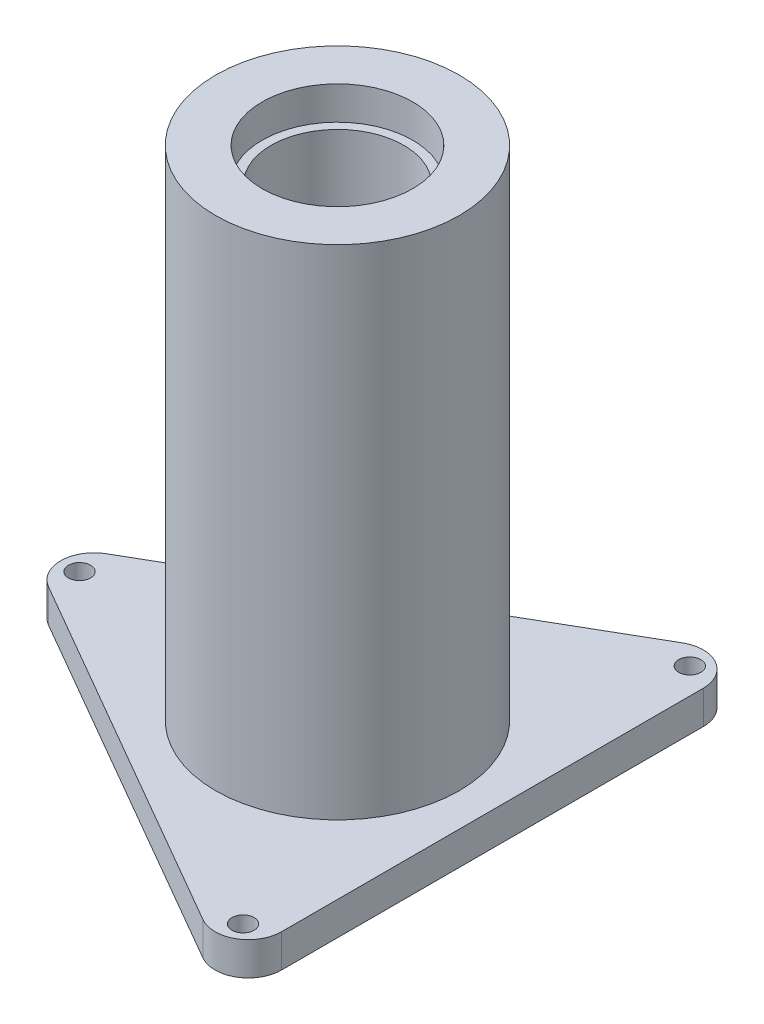
ISO-10303-21;
HEADER;
FILE_DESCRIPTION(('STEP AP214'),'2;1');
FILE_NAME('part.step','',(''),(''),'','','');
FILE_SCHEMA(('AUTOMOTIVE_DESIGN { 1 0 10303 214 1 1 1 1 }'));
ENDSEC;
DATA;
#1=APPLICATION_CONTEXT('core data for automotive mechanical design processes');
#2=APPLICATION_PROTOCOL_DEFINITION('international standard','automotive_design',2000,#1);
#3=PRODUCT_CONTEXT('',#1,'mechanical');
#4=PRODUCT('Part','Part','',(#3));
#5=PRODUCT_RELATED_PRODUCT_CATEGORY('part','',(#4));
#6=PRODUCT_DEFINITION_FORMATION('','',#4);
#7=PRODUCT_DEFINITION_CONTEXT('part definition',#1,'design');
#8=PRODUCT_DEFINITION('design','',#6,#7);
#9=PRODUCT_DEFINITION_SHAPE('','',#8);
#10=(LENGTH_UNIT() NAMED_UNIT(*) SI_UNIT(.MILLI.,.METRE.));
#11=(NAMED_UNIT(*) PLANE_ANGLE_UNIT() SI_UNIT($,.RADIAN.));
#12=(NAMED_UNIT(*) SI_UNIT($,.STERADIAN.) SOLID_ANGLE_UNIT());
#13=UNCERTAINTY_MEASURE_WITH_UNIT(LENGTH_MEASURE(1.E-05),#10,'distance_accuracy_value','');
#14=(GEOMETRIC_REPRESENTATION_CONTEXT(3) GLOBAL_UNCERTAINTY_ASSIGNED_CONTEXT((#13)) GLOBAL_UNIT_ASSIGNED_CONTEXT((#10,
#11,#12)) REPRESENTATION_CONTEXT('',''));
#15=CARTESIAN_POINT('',(0.,0.,0.));
#16=DIRECTION('',(0.,0.,1.));
#17=DIRECTION('',(1.,0.,0.));
#18=AXIS2_PLACEMENT_3D('',#15,#16,#17);
#19=CARTESIAN_POINT('',(6.00000000000001,-32.71875,0.));
#20=DIRECTION('',(0.,1.,0.));
#21=DIRECTION('',(0.,0.,1.));
#22=AXIS2_PLACEMENT_3D('',#19,#20,#21);
#23=PLANE('',#22);
#24=CARTESIAN_POINT('',(0.,-32.71875,0.));
#25=DIRECTION('',(0.,1.,0.));
#26=DIRECTION('',(0.,0.,1.));
#27=AXIS2_PLACEMENT_3D('',#24,#25,#26);
#28=CIRCLE('',#27,6.00000000000001);
#29=CARTESIAN_POINT('',(0.,-32.71875,6.00000000000001));
#30=VERTEX_POINT('',#29);
#31=EDGE_CURVE('E149',#30,#30,#28,.T.);
#32=ORIENTED_EDGE('',*,*,#31,.T.);
#33=EDGE_LOOP('',(#32));
#34=FACE_BOUND('',#33,.T.);
#35=CARTESIAN_POINT('',(0.,-32.71875,0.));
#36=DIRECTION('',(0.,-1.,0.));
#37=DIRECTION('',(0.,0.,-1.));
#38=AXIS2_PLACEMENT_3D('',#35,#36,#37);
#39=CIRCLE('',#38,6.8);
#40=CARTESIAN_POINT('',(0.,-32.71875,-6.8));
#41=VERTEX_POINT('',#40);
#42=EDGE_CURVE('E202',#41,#41,#39,.T.);
#43=ORIENTED_EDGE('',*,*,#42,.T.);
#44=EDGE_LOOP('',(#43));
#45=FACE_BOUND('',#44,.T.);
#46=ADVANCED_FACE('F39',(#34,#45),#23,.F.);
#47=CARTESIAN_POINT('',(0.,17.71875,0.));
#48=DIRECTION('',(0.,1.,0.));
#49=DIRECTION('',(0.,0.,1.));
#50=AXIS2_PLACEMENT_3D('',#47,#48,#49);
#51=CYLINDRICAL_SURFACE('',#50,11.);
#52=CARTESIAN_POINT('',(0.,12.28125,0.));
#53=DIRECTION('',(0.,1.,0.));
#54=DIRECTION('',(0.,0.,1.));
#55=AXIS2_PLACEMENT_3D('',#52,#53,#54);
#56=CIRCLE('',#55,11.);
#57=CARTESIAN_POINT('',(0.,12.28125,11.));
#58=VERTEX_POINT('',#57);
#59=EDGE_CURVE('E11',#58,#58,#56,.T.);
#60=ORIENTED_EDGE('',*,*,#59,.F.);
#61=EDGE_LOOP('',(#60));
#62=FACE_BOUND('',#61,.T.);
#63=CARTESIAN_POINT('',(0.,-32.71875,0.));
#64=DIRECTION('',(0.,1.,0.));
#65=DIRECTION('',(0.,0.,1.));
#66=AXIS2_PLACEMENT_3D('',#63,#64,#65);
#67=CIRCLE('',#66,11.);
#68=CARTESIAN_POINT('',(0.,-32.71875,11.));
#69=VERTEX_POINT('',#68);
#70=EDGE_CURVE('E146',#69,#69,#67,.T.);
#71=ORIENTED_EDGE('',*,*,#70,.T.);
#72=EDGE_LOOP('',(#71));
#73=FACE_BOUND('',#72,.T.);
#74=ADVANCED_FACE('F41',(#62,#73),#51,.T.);
#75=CARTESIAN_POINT('',(11.,12.28125,0.));
#76=DIRECTION('',(0.,-1.,0.));
#77=DIRECTION('',(0.,0.,-1.));
#78=AXIS2_PLACEMENT_3D('',#75,#76,#77);
#79=PLANE('',#78);
#80=CARTESIAN_POINT('',(0.,12.28125,0.));
#81=DIRECTION('',(0.,1.,0.));
#82=DIRECTION('',(0.,0.,1.));
#83=AXIS2_PLACEMENT_3D('',#80,#81,#82);
#84=CIRCLE('',#83,6.8);
#85=CARTESIAN_POINT('',(0.,12.28125,6.8));
#86=VERTEX_POINT('',#85);
#87=EDGE_CURVE('E48',#86,#86,#84,.T.);
#88=ORIENTED_EDGE('',*,*,#87,.F.);
#89=EDGE_LOOP('',(#88));
#90=FACE_BOUND('',#89,.T.);
#91=ORIENTED_EDGE('',*,*,#59,.T.);
#92=EDGE_LOOP('',(#91));
#93=FACE_BOUND('',#92,.T.);
#94=ADVANCED_FACE('F162',(#90,#93),#79,.F.);
#95=CARTESIAN_POINT('',(0.,17.71875,0.));
#96=DIRECTION('',(0.,1.,0.));
#97=DIRECTION('',(0.,0.,1.));
#98=AXIS2_PLACEMENT_3D('',#95,#96,#97);
#99=CYLINDRICAL_SURFACE('',#98,6.8);
#100=CARTESIAN_POINT('',(0.,9.28124999999999,0.));
#101=DIRECTION('',(0.,1.,0.));
#102=DIRECTION('',(0.,0.,1.));
#103=AXIS2_PLACEMENT_3D('',#100,#101,#102);
#104=CIRCLE('',#103,6.8);
#105=CARTESIAN_POINT('',(0.,9.28124999999999,6.8));
#106=VERTEX_POINT('',#105);
#107=EDGE_CURVE('E155',#106,#106,#104,.T.);
#108=ORIENTED_EDGE('',*,*,#107,.F.);
#109=EDGE_LOOP('',(#108));
#110=FACE_BOUND('',#109,.T.);
#111=ORIENTED_EDGE('',*,*,#87,.T.);
#112=EDGE_LOOP('',(#111));
#113=FACE_BOUND('',#112,.T.);
#114=ADVANCED_FACE('F160',(#110,#113),#99,.F.);
#115=CARTESIAN_POINT('',(6.8,9.28124999999999,0.));
#116=DIRECTION('',(0.,-1.,0.));
#117=DIRECTION('',(0.,0.,-1.));
#118=AXIS2_PLACEMENT_3D('',#115,#116,#117);
#119=PLANE('',#118);
#120=CARTESIAN_POINT('',(0.,9.28124999999999,0.));
#121=DIRECTION('',(0.,1.,0.));
#122=DIRECTION('',(0.,0.,1.));
#123=AXIS2_PLACEMENT_3D('',#120,#121,#122);
#124=CIRCLE('',#123,6.);
#125=CARTESIAN_POINT('',(0.,9.28124999999999,6.));
#126=VERTEX_POINT('',#125);
#127=EDGE_CURVE('E152',#126,#126,#124,.T.);
#128=ORIENTED_EDGE('',*,*,#127,.F.);
#129=EDGE_LOOP('',(#128));
#130=FACE_BOUND('',#129,.T.);
#131=ORIENTED_EDGE('',*,*,#107,.T.);
#132=EDGE_LOOP('',(#131));
#133=FACE_BOUND('',#132,.T.);
#134=ADVANCED_FACE('F240',(#130,#133),#119,.F.);
#135=CARTESIAN_POINT('',(0.,17.71875,0.));
#136=DIRECTION('',(0.,1.,0.));
#137=DIRECTION('',(0.,0.,1.));
#138=AXIS2_PLACEMENT_3D('',#135,#136,#137);
#139=CYLINDRICAL_SURFACE('',#138,6.);
#140=ORIENTED_EDGE('',*,*,#31,.F.);
#141=EDGE_LOOP('',(#140));
#142=FACE_BOUND('',#141,.T.);
#143=ORIENTED_EDGE('',*,*,#127,.T.);
#144=EDGE_LOOP('',(#143));
#145=FACE_BOUND('',#144,.T.);
#146=ADVANCED_FACE('F237',(#142,#145),#139,.F.);
#147=CARTESIAN_POINT('',(11.,-35.71875,-19.0525588832577));
#148=DIRECTION('',(0.,-1.,0.));
#149=DIRECTION('',(0.,0.,-1.));
#150=AXIS2_PLACEMENT_3D('',#147,#148,#149);
#151=PLANE('',#150);
#152=CARTESIAN_POINT('',(-23.3,-35.71875,0.));
#153=DIRECTION('',(0.,-1.,0.));
#154=DIRECTION('',(0.,0.,-1.));
#155=AXIS2_PLACEMENT_3D('',#152,#153,#154);
#156=CIRCLE('',#155,1.);
#157=CARTESIAN_POINT('',(-23.3,-35.71875,-1.));
#158=VERTEX_POINT('',#157);
#159=EDGE_CURVE('E195',#158,#158,#156,.T.);
#160=ORIENTED_EDGE('',*,*,#159,.F.);
#161=EDGE_LOOP('',(#160));
#162=FACE_BOUND('',#161,.T.);
#163=CARTESIAN_POINT('',(0.,-35.71875,0.));
#164=DIRECTION('',(0.,-1.,0.));
#165=DIRECTION('',(0.,0.,-1.));
#166=AXIS2_PLACEMENT_3D('',#163,#164,#165);
#167=CIRCLE('',#166,6.8);
#168=CARTESIAN_POINT('',(0.,-35.71875,-6.8));
#169=VERTEX_POINT('',#168);
#170=EDGE_CURVE('E130',#169,#169,#167,.T.);
#171=ORIENTED_EDGE('',*,*,#170,.F.);
#172=EDGE_LOOP('',(#171));
#173=FACE_BOUND('',#172,.T.);
#174=CARTESIAN_POINT('',(11.,-35.71875,-19.0525588832577));
#175=DIRECTION('',(0.,-1.,0.));
#176=DIRECTION('',(0.,0.,-1.));
#177=AXIS2_PLACEMENT_3D('',#174,#175,#176);
#178=CIRCLE('',#177,3.);
#179=CARTESIAN_POINT('',(9.49999999999999,-35.71875,-21.650635094611));
#180=VERTEX_POINT('',#179);
#181=CARTESIAN_POINT('',(14.,-35.71875,-19.0525588832577));
#182=VERTEX_POINT('',#181);
#183=EDGE_CURVE('E137',#180,#182,#178,.T.);
#184=ORIENTED_EDGE('',*,*,#183,.T.);
#185=DIRECTION('',(0.,0.,1.));
#186=VECTOR('',#185,1.);
#187=CARTESIAN_POINT('',(14.,-35.71875,-19.0525588832577));
#188=LINE('',#187,#186);
#189=CARTESIAN_POINT('',(14.,-35.71875,19.0525588832577));
#190=VERTEX_POINT('',#189);
#191=EDGE_CURVE('E94',#182,#190,#188,.T.);
#192=ORIENTED_EDGE('',*,*,#191,.T.);
#193=CARTESIAN_POINT('',(11.,-35.71875,19.0525588832577));
#194=DIRECTION('',(0.,-1.,0.));
#195=DIRECTION('',(0.,0.,-1.));
#196=AXIS2_PLACEMENT_3D('',#193,#194,#195);
#197=CIRCLE('',#196,3.);
#198=CARTESIAN_POINT('',(9.50000000000001,-35.71875,21.650635094611));
#199=VERTEX_POINT('',#198);
#200=EDGE_CURVE('E108',#190,#199,#197,.T.);
#201=ORIENTED_EDGE('',*,*,#200,.T.);
#202=DIRECTION('',(-0.866025403784439,0.,-0.5));
#203=VECTOR('',#202,1.);
#204=CARTESIAN_POINT('',(9.50000000000001,-35.71875,21.650635094611));
#205=LINE('',#204,#203);
#206=CARTESIAN_POINT('',(-23.5,-35.71875,2.59807621135331));
#207=VERTEX_POINT('',#206);
#208=EDGE_CURVE('E101',#199,#207,#205,.T.);
#209=ORIENTED_EDGE('',*,*,#208,.T.);
#210=CARTESIAN_POINT('',(-22.,-35.71875,0.));
#211=DIRECTION('',(0.,-1.,0.));
#212=DIRECTION('',(0.,0.,1.));
#213=AXIS2_PLACEMENT_3D('',#210,#211,#212);
#214=CIRCLE('',#213,3.);
#215=CARTESIAN_POINT('',(-23.5,-35.71875,-2.59807621135331));
#216=VERTEX_POINT('',#215);
#217=EDGE_CURVE('E106',#207,#216,#214,.T.);
#218=ORIENTED_EDGE('',*,*,#217,.T.);
#219=DIRECTION('',(0.866025403784439,0.,-0.5));
#220=VECTOR('',#219,1.);
#221=CARTESIAN_POINT('',(-23.5,-35.71875,-2.59807621135331));
#222=LINE('',#221,#220);
#223=EDGE_CURVE('E56',#216,#180,#222,.T.);
#224=ORIENTED_EDGE('',*,*,#223,.T.);
#225=EDGE_LOOP('',(#184,#192,#201,#209,#218,#224));
#226=FACE_BOUND('',#225,.T.);
#227=CARTESIAN_POINT('',(11.65,-35.71875,20.1783919081774));
#228=DIRECTION('',(0.,-1.,0.));
#229=DIRECTION('',(0.,0.,-1.));
#230=AXIS2_PLACEMENT_3D('',#227,#228,#229);
#231=CIRCLE('',#230,1.);
#232=CARTESIAN_POINT('',(11.65,-35.71875,19.1783919081774));
#233=VERTEX_POINT('',#232);
#234=EDGE_CURVE('E199',#233,#233,#231,.T.);
#235=ORIENTED_EDGE('',*,*,#234,.F.);
#236=EDGE_LOOP('',(#235));
#237=FACE_BOUND('',#236,.T.);
#238=CARTESIAN_POINT('',(11.65,-35.71875,-20.1783919081774));
#239=DIRECTION('',(0.,-1.,0.));
#240=DIRECTION('',(0.,0.,-1.));
#241=AXIS2_PLACEMENT_3D('',#238,#239,#240);
#242=CIRCLE('',#241,1.);
#243=CARTESIAN_POINT('',(11.65,-35.71875,-21.1783919081774));
#244=VERTEX_POINT('',#243);
#245=EDGE_CURVE('E190',#244,#244,#242,.T.);
#246=ORIENTED_EDGE('',*,*,#245,.F.);
#247=EDGE_LOOP('',(#246));
#248=FACE_BOUND('',#247,.T.);
#249=ADVANCED_FACE('F103',(#162,#173,#226,#237,#248),#151,.T.);
#250=CARTESIAN_POINT('',(11.,-32.71875,-19.0525588832577));
#251=DIRECTION('',(0.,-1.,0.));
#252=DIRECTION('',(0.,0.,-1.));
#253=AXIS2_PLACEMENT_3D('',#250,#251,#252);
#254=PLANE('',#253);
#255=ORIENTED_EDGE('',*,*,#70,.F.);
#256=EDGE_LOOP('',(#255));
#257=FACE_BOUND('',#256,.T.);
#258=CARTESIAN_POINT('',(11.,-32.71875,-19.0525588832577));
#259=DIRECTION('',(0.,-1.,0.));
#260=DIRECTION('',(0.,0.,-1.));
#261=AXIS2_PLACEMENT_3D('',#258,#259,#260);
#262=CIRCLE('',#261,3.);
#263=CARTESIAN_POINT('',(9.49999999999999,-32.71875,-21.650635094611));
#264=VERTEX_POINT('',#263);
#265=CARTESIAN_POINT('',(14.,-32.71875,-19.0525588832577));
#266=VERTEX_POINT('',#265);
#267=EDGE_CURVE('E126',#264,#266,#262,.T.);
#268=ORIENTED_EDGE('',*,*,#267,.F.);
#269=DIRECTION('',(0.866025403784439,0.,-0.5));
#270=VECTOR('',#269,1.);
#271=CARTESIAN_POINT('',(-23.5,-32.71875,-2.59807621135331));
#272=LINE('',#271,#270);
#273=CARTESIAN_POINT('',(-23.5,-32.71875,-2.59807621135331));
#274=VERTEX_POINT('',#273);
#275=EDGE_CURVE('E85',#274,#264,#272,.T.);
#276=ORIENTED_EDGE('',*,*,#275,.F.);
#277=CARTESIAN_POINT('',(-22.,-32.71875,0.));
#278=DIRECTION('',(0.,-1.,0.));
#279=DIRECTION('',(0.,0.,1.));
#280=AXIS2_PLACEMENT_3D('',#277,#278,#279);
#281=CIRCLE('',#280,3.);
#282=CARTESIAN_POINT('',(-23.5,-32.71875,2.59807621135331));
#283=VERTEX_POINT('',#282);
#284=EDGE_CURVE('E79',#283,#274,#281,.T.);
#285=ORIENTED_EDGE('',*,*,#284,.F.);
#286=DIRECTION('',(-0.866025403784439,0.,-0.5));
#287=VECTOR('',#286,1.);
#288=CARTESIAN_POINT('',(9.50000000000001,-32.71875,21.650635094611));
#289=LINE('',#288,#287);
#290=CARTESIAN_POINT('',(9.50000000000001,-32.71875,21.650635094611));
#291=VERTEX_POINT('',#290);
#292=EDGE_CURVE('E116',#291,#283,#289,.T.);
#293=ORIENTED_EDGE('',*,*,#292,.F.);
#294=CARTESIAN_POINT('',(11.,-32.71875,19.0525588832577));
#295=DIRECTION('',(0.,-1.,0.));
#296=DIRECTION('',(0.,0.,-1.));
#297=AXIS2_PLACEMENT_3D('',#294,#295,#296);
#298=CIRCLE('',#297,3.);
#299=CARTESIAN_POINT('',(14.,-32.71875,19.0525588832577));
#300=VERTEX_POINT('',#299);
#301=EDGE_CURVE('E132',#300,#291,#298,.T.);
#302=ORIENTED_EDGE('',*,*,#301,.F.);
#303=DIRECTION('',(0.,0.,1.));
#304=VECTOR('',#303,1.);
#305=CARTESIAN_POINT('',(14.,-32.71875,-19.0525588832577));
#306=LINE('',#305,#304);
#307=EDGE_CURVE('E129',#266,#300,#306,.T.);
#308=ORIENTED_EDGE('',*,*,#307,.F.);
#309=EDGE_LOOP('',(#268,#276,#285,#293,#302,#308));
#310=FACE_BOUND('',#309,.T.);
#311=CARTESIAN_POINT('',(11.65,-32.71875,20.1783919081774));
#312=DIRECTION('',(0.,-1.,0.));
#313=DIRECTION('',(0.,0.,-1.));
#314=AXIS2_PLACEMENT_3D('',#311,#312,#313);
#315=CIRCLE('',#314,1.);
#316=CARTESIAN_POINT('',(11.65,-32.71875,19.1783919081774));
#317=VERTEX_POINT('',#316);
#318=EDGE_CURVE('E181',#317,#317,#315,.T.);
#319=ORIENTED_EDGE('',*,*,#318,.T.);
#320=EDGE_LOOP('',(#319));
#321=FACE_BOUND('',#320,.T.);
#322=CARTESIAN_POINT('',(-23.3,-32.71875,0.));
#323=DIRECTION('',(0.,-1.,0.));
#324=DIRECTION('',(0.,0.,-1.));
#325=AXIS2_PLACEMENT_3D('',#322,#323,#324);
#326=CIRCLE('',#325,1.);
#327=CARTESIAN_POINT('',(-23.3,-32.71875,-1.));
#328=VERTEX_POINT('',#327);
#329=EDGE_CURVE('E185',#328,#328,#326,.T.);
#330=ORIENTED_EDGE('',*,*,#329,.T.);
#331=EDGE_LOOP('',(#330));
#332=FACE_BOUND('',#331,.T.);
#333=CARTESIAN_POINT('',(11.65,-32.71875,-20.1783919081774));
#334=DIRECTION('',(0.,-1.,0.));
#335=DIRECTION('',(0.,0.,-1.));
#336=AXIS2_PLACEMENT_3D('',#333,#334,#335);
#337=CIRCLE('',#336,1.);
#338=CARTESIAN_POINT('',(11.65,-32.71875,-21.1783919081774));
#339=VERTEX_POINT('',#338);
#340=EDGE_CURVE('E188',#339,#339,#337,.T.);
#341=ORIENTED_EDGE('',*,*,#340,.T.);
#342=EDGE_LOOP('',(#341));
#343=FACE_BOUND('',#342,.T.);
#344=ADVANCED_FACE('F171',(#257,#310,#321,#332,#343),#254,.F.);
#345=CARTESIAN_POINT('',(11.,-35.71875,-19.0525588832577));
#346=DIRECTION('',(0.,1.,0.));
#347=DIRECTION('',(0.,0.,1.));
#348=AXIS2_PLACEMENT_3D('',#345,#346,#347);
#349=CYLINDRICAL_SURFACE('',#348,3.);
#350=ORIENTED_EDGE('',*,*,#267,.T.);
#351=DIRECTION('',(0.,1.,0.));
#352=VECTOR('',#351,1.);
#353=CARTESIAN_POINT('',(14.,-35.71875,-19.0525588832577));
#354=LINE('',#353,#352);
#355=EDGE_CURVE('E144',#182,#266,#354,.T.);
#356=ORIENTED_EDGE('',*,*,#355,.F.);
#357=ORIENTED_EDGE('',*,*,#183,.F.);
#358=DIRECTION('',(0.,1.,0.));
#359=VECTOR('',#358,1.);
#360=CARTESIAN_POINT('',(9.49999999999999,-35.71875,-21.650635094611));
#361=LINE('',#360,#359);
#362=EDGE_CURVE('E122',#180,#264,#361,.T.);
#363=ORIENTED_EDGE('',*,*,#362,.T.);
#364=EDGE_LOOP('',(#350,#356,#357,#363));
#365=FACE_BOUND('',#364,.T.);
#366=ADVANCED_FACE('F174',(#365),#349,.T.);
#367=CARTESIAN_POINT('',(14.,-35.71875,-19.0525588832577));
#368=DIRECTION('',(-1.,0.,0.));
#369=DIRECTION('',(0.,0.,1.));
#370=AXIS2_PLACEMENT_3D('',#367,#368,#369);
#371=PLANE('',#370);
#372=ORIENTED_EDGE('',*,*,#307,.T.);
#373=DIRECTION('',(0.,1.,0.));
#374=VECTOR('',#373,1.);
#375=CARTESIAN_POINT('',(14.,-35.71875,19.0525588832577));
#376=LINE('',#375,#374);
#377=EDGE_CURVE('E141',#190,#300,#376,.T.);
#378=ORIENTED_EDGE('',*,*,#377,.F.);
#379=ORIENTED_EDGE('',*,*,#191,.F.);
#380=ORIENTED_EDGE('',*,*,#355,.T.);
#381=EDGE_LOOP('',(#372,#378,#379,#380));
#382=FACE_BOUND('',#381,.T.);
#383=ADVANCED_FACE('F211',(#382),#371,.F.);
#384=CARTESIAN_POINT('',(11.,-35.71875,19.0525588832577));
#385=DIRECTION('',(0.,1.,0.));
#386=DIRECTION('',(0.,0.,1.));
#387=AXIS2_PLACEMENT_3D('',#384,#385,#386);
#388=CYLINDRICAL_SURFACE('',#387,3.);
#389=ORIENTED_EDGE('',*,*,#301,.T.);
#390=DIRECTION('',(0.,1.,0.));
#391=VECTOR('',#390,1.);
#392=CARTESIAN_POINT('',(9.50000000000001,-35.71875,21.650635094611));
#393=LINE('',#392,#391);
#394=EDGE_CURVE('E117',#199,#291,#393,.T.);
#395=ORIENTED_EDGE('',*,*,#394,.F.);
#396=ORIENTED_EDGE('',*,*,#200,.F.);
#397=ORIENTED_EDGE('',*,*,#377,.T.);
#398=EDGE_LOOP('',(#389,#395,#396,#397));
#399=FACE_BOUND('',#398,.T.);
#400=ADVANCED_FACE('F214',(#399),#388,.T.);
#401=CARTESIAN_POINT('',(9.50000000000001,-35.71875,21.650635094611));
#402=DIRECTION('',(0.5,0.,-0.866025403784439));
#403=DIRECTION('',(-0.866025403784439,0.,-0.5));
#404=AXIS2_PLACEMENT_3D('',#401,#402,#403);
#405=PLANE('',#404);
#406=ORIENTED_EDGE('',*,*,#292,.T.);
#407=DIRECTION('',(0.,1.,0.));
#408=VECTOR('',#407,1.);
#409=CARTESIAN_POINT('',(-23.5,-35.71875,2.59807621135331));
#410=LINE('',#409,#408);
#411=EDGE_CURVE('E113',#207,#283,#410,.T.);
#412=ORIENTED_EDGE('',*,*,#411,.F.);
#413=ORIENTED_EDGE('',*,*,#208,.F.);
#414=ORIENTED_EDGE('',*,*,#394,.T.);
#415=EDGE_LOOP('',(#406,#412,#413,#414));
#416=FACE_BOUND('',#415,.T.);
#417=ADVANCED_FACE('F114',(#416),#405,.F.);
#418=CARTESIAN_POINT('',(-22.,-35.71875,0.));
#419=DIRECTION('',(0.,1.,0.));
#420=DIRECTION('',(0.,0.,1.));
#421=AXIS2_PLACEMENT_3D('',#418,#419,#420);
#422=CYLINDRICAL_SURFACE('',#421,3.);
#423=ORIENTED_EDGE('',*,*,#284,.T.);
#424=DIRECTION('',(0.,1.,0.));
#425=VECTOR('',#424,1.);
#426=CARTESIAN_POINT('',(-23.5,-35.71875,-2.59807621135331));
#427=LINE('',#426,#425);
#428=EDGE_CURVE('E118',#216,#274,#427,.T.);
#429=ORIENTED_EDGE('',*,*,#428,.F.);
#430=ORIENTED_EDGE('',*,*,#217,.F.);
#431=ORIENTED_EDGE('',*,*,#411,.T.);
#432=EDGE_LOOP('',(#423,#429,#430,#431));
#433=FACE_BOUND('',#432,.T.);
#434=ADVANCED_FACE('F120',(#433),#422,.T.);
#435=CARTESIAN_POINT('',(-23.5,-35.71875,-2.59807621135331));
#436=DIRECTION('',(0.5,0.,0.866025403784438));
#437=DIRECTION('',(0.866025403784439,0.,-0.5));
#438=AXIS2_PLACEMENT_3D('',#435,#436,#437);
#439=PLANE('',#438);
#440=ORIENTED_EDGE('',*,*,#275,.T.);
#441=ORIENTED_EDGE('',*,*,#362,.F.);
#442=ORIENTED_EDGE('',*,*,#223,.F.);
#443=ORIENTED_EDGE('',*,*,#428,.T.);
#444=EDGE_LOOP('',(#440,#441,#442,#443));
#445=FACE_BOUND('',#444,.T.);
#446=ADVANCED_FACE('F216',(#445),#439,.F.);
#447=CARTESIAN_POINT('',(0.,-35.71875,0.));
#448=DIRECTION('',(0.,1.,0.));
#449=DIRECTION('',(0.,0.,1.));
#450=AXIS2_PLACEMENT_3D('',#447,#448,#449);
#451=CYLINDRICAL_SURFACE('',#450,6.8);
#452=ORIENTED_EDGE('',*,*,#170,.T.);
#453=EDGE_LOOP('',(#452));
#454=FACE_BOUND('',#453,.T.);
#455=ORIENTED_EDGE('',*,*,#42,.F.);
#456=EDGE_LOOP('',(#455));
#457=FACE_BOUND('',#456,.T.);
#458=ADVANCED_FACE('F218',(#454,#457),#451,.F.);
#459=CARTESIAN_POINT('',(11.65,-35.71875,20.1783919081774));
#460=DIRECTION('',(0.,1.,0.));
#461=DIRECTION('',(0.,0.,1.));
#462=AXIS2_PLACEMENT_3D('',#459,#460,#461);
#463=CYLINDRICAL_SURFACE('',#462,1.);
#464=ORIENTED_EDGE('',*,*,#234,.T.);
#465=EDGE_LOOP('',(#464));
#466=FACE_BOUND('',#465,.T.);
#467=ORIENTED_EDGE('',*,*,#318,.F.);
#468=EDGE_LOOP('',(#467));
#469=FACE_BOUND('',#468,.T.);
#470=ADVANCED_FACE('F224',(#466,#469),#463,.F.);
#471=CARTESIAN_POINT('',(-23.3,-35.71875,0.));
#472=DIRECTION('',(0.,1.,0.));
#473=DIRECTION('',(0.,0.,1.));
#474=AXIS2_PLACEMENT_3D('',#471,#472,#473);
#475=CYLINDRICAL_SURFACE('',#474,1.);
#476=ORIENTED_EDGE('',*,*,#159,.T.);
#477=EDGE_LOOP('',(#476));
#478=FACE_BOUND('',#477,.T.);
#479=ORIENTED_EDGE('',*,*,#329,.F.);
#480=EDGE_LOOP('',(#479));
#481=FACE_BOUND('',#480,.T.);
#482=ADVANCED_FACE('F317',(#478,#481),#475,.F.);
#483=CARTESIAN_POINT('',(11.65,-35.71875,-20.1783919081774));
#484=DIRECTION('',(0.,1.,0.));
#485=DIRECTION('',(0.,0.,1.));
#486=AXIS2_PLACEMENT_3D('',#483,#484,#485);
#487=CYLINDRICAL_SURFACE('',#486,1.);
#488=ORIENTED_EDGE('',*,*,#245,.T.);
#489=EDGE_LOOP('',(#488));
#490=FACE_BOUND('',#489,.T.);
#491=ORIENTED_EDGE('',*,*,#340,.F.);
#492=EDGE_LOOP('',(#491));
#493=FACE_BOUND('',#492,.T.);
#494=ADVANCED_FACE('F327',(#490,#493),#487,.F.);
#495=CLOSED_SHELL('',(#46,#74,#94,#114,#134,#146,#249,#344,#366,#383,#400,#417,#434,#446,#458,
#470,#482,#494));
#496=MANIFOLD_SOLID_BREP('B2',#495);
#497=ADVANCED_BREP_SHAPE_REPRESENTATION('',(#18,#496),#14);
#498=SHAPE_DEFINITION_REPRESENTATION(#9,#497);
ENDSEC;
END-ISO-10303-21;
